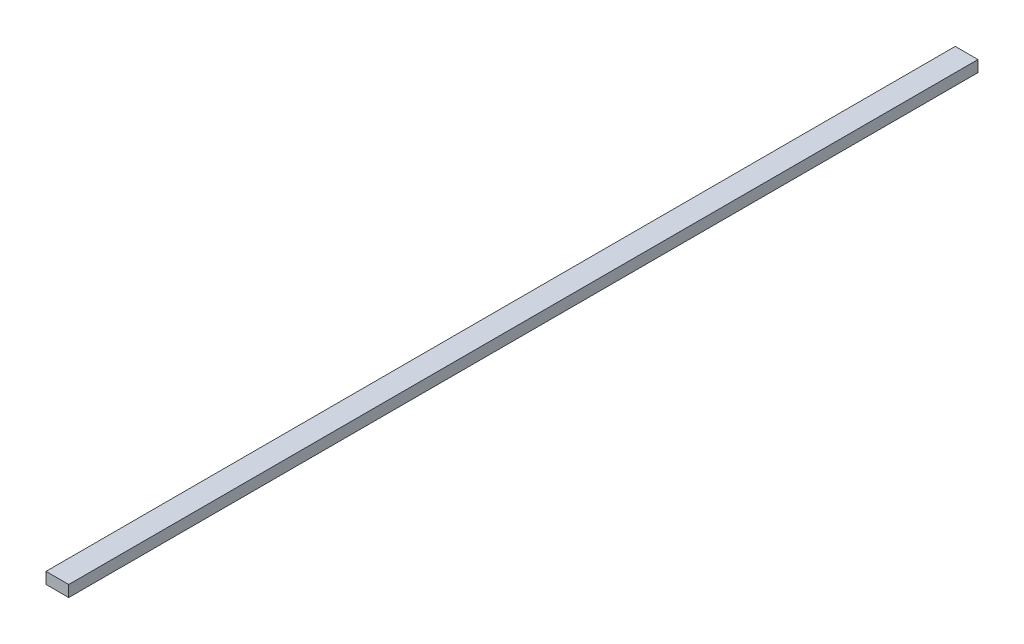
ISO-10303-21;
HEADER;
FILE_DESCRIPTION(('STEP AP214'),'2;1');
FILE_NAME('part.step','',(''),(''),'','','');
FILE_SCHEMA(('AUTOMOTIVE_DESIGN { 1 0 10303 214 1 1 1 1 }'));
ENDSEC;
DATA;
#1=APPLICATION_CONTEXT('core data for automotive mechanical design processes');
#2=APPLICATION_PROTOCOL_DEFINITION('international standard','automotive_design',2000,#1);
#3=PRODUCT_CONTEXT('',#1,'mechanical');
#4=PRODUCT('Part','Part','',(#3));
#5=PRODUCT_RELATED_PRODUCT_CATEGORY('part','',(#4));
#6=PRODUCT_DEFINITION_FORMATION('','',#4);
#7=PRODUCT_DEFINITION_CONTEXT('part definition',#1,'design');
#8=PRODUCT_DEFINITION('design','',#6,#7);
#9=PRODUCT_DEFINITION_SHAPE('','',#8);
#10=(LENGTH_UNIT() NAMED_UNIT(*) SI_UNIT(.MILLI.,.METRE.));
#11=(NAMED_UNIT(*) PLANE_ANGLE_UNIT() SI_UNIT($,.RADIAN.));
#12=(NAMED_UNIT(*) SI_UNIT($,.STERADIAN.) SOLID_ANGLE_UNIT());
#13=UNCERTAINTY_MEASURE_WITH_UNIT(LENGTH_MEASURE(1.E-05),#10,'distance_accuracy_value','');
#14=(GEOMETRIC_REPRESENTATION_CONTEXT(3) GLOBAL_UNCERTAINTY_ASSIGNED_CONTEXT((#13)) GLOBAL_UNIT_ASSIGNED_CONTEXT((#10,
#11,#12)) REPRESENTATION_CONTEXT('',''));
#15=CARTESIAN_POINT('',(0.,0.,0.));
#16=DIRECTION('',(0.,0.,1.));
#17=DIRECTION('',(1.,0.,0.));
#18=AXIS2_PLACEMENT_3D('',#15,#16,#17);
#19=CARTESIAN_POINT('',(6.25,-3.125,500.));
#20=DIRECTION('',(-1.,0.,0.));
#21=DIRECTION('',(0.,0.,1.));
#22=AXIS2_PLACEMENT_3D('',#19,#20,#21);
#23=PLANE('',#22);
#24=DIRECTION('',(0.,1.,0.));
#25=VECTOR('',#24,1.);
#26=CARTESIAN_POINT('',(6.25,-3.125,0.));
#27=LINE('',#26,#25);
#28=CARTESIAN_POINT('',(6.25,-3.125,0.));
#29=VERTEX_POINT('',#28);
#30=CARTESIAN_POINT('',(6.25,3.125,0.));
#31=VERTEX_POINT('',#30);
#32=EDGE_CURVE('E107',#29,#31,#27,.T.);
#33=ORIENTED_EDGE('',*,*,#32,.T.);
#34=DIRECTION('',(0.,0.,-1.));
#35=VECTOR('',#34,1.);
#36=CARTESIAN_POINT('',(6.25,3.125,500.));
#37=LINE('',#36,#35);
#38=CARTESIAN_POINT('',(6.25,3.125,500.));
#39=VERTEX_POINT('',#38);
#40=EDGE_CURVE('E11',#39,#31,#37,.T.);
#41=ORIENTED_EDGE('',*,*,#40,.F.);
#42=DIRECTION('',(0.,1.,0.));
#43=VECTOR('',#42,1.);
#44=CARTESIAN_POINT('',(6.25,-3.125,500.));
#45=LINE('',#44,#43);
#46=CARTESIAN_POINT('',(6.25,-3.125,500.));
#47=VERTEX_POINT('',#46);
#48=EDGE_CURVE('E91',#47,#39,#45,.T.);
#49=ORIENTED_EDGE('',*,*,#48,.F.);
#50=DIRECTION('',(0.,0.,-1.));
#51=VECTOR('',#50,1.);
#52=CARTESIAN_POINT('',(6.25,-3.125,500.));
#53=LINE('',#52,#51);
#54=EDGE_CURVE('E103',#47,#29,#53,.T.);
#55=ORIENTED_EDGE('',*,*,#54,.T.);
#56=EDGE_LOOP('',(#33,#41,#49,#55));
#57=FACE_BOUND('',#56,.T.);
#58=ADVANCED_FACE('F39',(#57),#23,.F.);
#59=CARTESIAN_POINT('',(-6.25,3.125,500.));
#60=DIRECTION('',(0.,-1.,0.));
#61=DIRECTION('',(0.,0.,-1.));
#62=AXIS2_PLACEMENT_3D('',#59,#60,#61);
#63=PLANE('',#62);
#64=DIRECTION('',(-1.,0.,0.));
#65=VECTOR('',#64,1.);
#66=CARTESIAN_POINT('',(-6.25,3.125,0.));
#67=LINE('',#66,#65);
#68=CARTESIAN_POINT('',(-6.25,3.125,0.));
#69=VERTEX_POINT('',#68);
#70=EDGE_CURVE('E96',#31,#69,#67,.T.);
#71=ORIENTED_EDGE('',*,*,#70,.T.);
#72=DIRECTION('',(0.,0.,-1.));
#73=VECTOR('',#72,1.);
#74=CARTESIAN_POINT('',(-6.25,3.125,500.));
#75=LINE('',#74,#73);
#76=CARTESIAN_POINT('',(-6.25,3.125,500.));
#77=VERTEX_POINT('',#76);
#78=EDGE_CURVE('E48',#77,#69,#75,.T.);
#79=ORIENTED_EDGE('',*,*,#78,.F.);
#80=DIRECTION('',(-1.,0.,0.));
#81=VECTOR('',#80,1.);
#82=CARTESIAN_POINT('',(-6.25,3.125,500.));
#83=LINE('',#82,#81);
#84=EDGE_CURVE('E86',#39,#77,#83,.T.);
#85=ORIENTED_EDGE('',*,*,#84,.F.);
#86=ORIENTED_EDGE('',*,*,#40,.T.);
#87=EDGE_LOOP('',(#71,#79,#85,#86));
#88=FACE_BOUND('',#87,.T.);
#89=ADVANCED_FACE('F95',(#88),#63,.F.);
#90=CARTESIAN_POINT('',(-6.25,-3.125,500.));
#91=DIRECTION('',(1.,0.,0.));
#92=DIRECTION('',(0.,0.,-1.));
#93=AXIS2_PLACEMENT_3D('',#90,#91,#92);
#94=PLANE('',#93);
#95=DIRECTION('',(0.,-1.,0.));
#96=VECTOR('',#95,1.);
#97=CARTESIAN_POINT('',(-6.25,-3.125,0.));
#98=LINE('',#97,#96);
#99=CARTESIAN_POINT('',(-6.25,-3.125,0.));
#100=VERTEX_POINT('',#99);
#101=EDGE_CURVE('E73',#69,#100,#98,.T.);
#102=ORIENTED_EDGE('',*,*,#101,.T.);
#103=DIRECTION('',(0.,0.,-1.));
#104=VECTOR('',#103,1.);
#105=CARTESIAN_POINT('',(-6.25,-3.125,500.));
#106=LINE('',#105,#104);
#107=CARTESIAN_POINT('',(-6.25,-3.125,500.));
#108=VERTEX_POINT('',#107);
#109=EDGE_CURVE('E98',#108,#100,#106,.T.);
#110=ORIENTED_EDGE('',*,*,#109,.F.);
#111=DIRECTION('',(0.,-1.,0.));
#112=VECTOR('',#111,1.);
#113=CARTESIAN_POINT('',(-6.25,-3.125,500.));
#114=LINE('',#113,#112);
#115=EDGE_CURVE('E89',#77,#108,#114,.T.);
#116=ORIENTED_EDGE('',*,*,#115,.F.);
#117=ORIENTED_EDGE('',*,*,#78,.T.);
#118=EDGE_LOOP('',(#102,#110,#116,#117));
#119=FACE_BOUND('',#118,.T.);
#120=ADVANCED_FACE('F99',(#119),#94,.F.);
#121=CARTESIAN_POINT('',(-6.25,-3.125,500.));
#122=DIRECTION('',(0.,1.,0.));
#123=DIRECTION('',(0.,0.,1.));
#124=AXIS2_PLACEMENT_3D('',#121,#122,#123);
#125=PLANE('',#124);
#126=DIRECTION('',(1.,0.,0.));
#127=VECTOR('',#126,1.);
#128=CARTESIAN_POINT('',(-6.25,-3.125,0.));
#129=LINE('',#128,#127);
#130=EDGE_CURVE('E79',#100,#29,#129,.T.);
#131=ORIENTED_EDGE('',*,*,#130,.T.);
#132=ORIENTED_EDGE('',*,*,#54,.F.);
#133=DIRECTION('',(1.,0.,0.));
#134=VECTOR('',#133,1.);
#135=CARTESIAN_POINT('',(-6.25,-3.125,500.));
#136=LINE('',#135,#134);
#137=EDGE_CURVE('E56',#108,#47,#136,.T.);
#138=ORIENTED_EDGE('',*,*,#137,.F.);
#139=ORIENTED_EDGE('',*,*,#109,.T.);
#140=EDGE_LOOP('',(#131,#132,#138,#139));
#141=FACE_BOUND('',#140,.T.);
#142=ADVANCED_FACE('F120',(#141),#125,.F.);
#143=CARTESIAN_POINT('',(0.,0.,500.));
#144=DIRECTION('',(0.,0.,-1.));
#145=DIRECTION('',(-1.,0.,0.));
#146=AXIS2_PLACEMENT_3D('',#143,#144,#145);
#147=PLANE('',#146);
#148=ORIENTED_EDGE('',*,*,#48,.T.);
#149=ORIENTED_EDGE('',*,*,#84,.T.);
#150=ORIENTED_EDGE('',*,*,#115,.T.);
#151=ORIENTED_EDGE('',*,*,#137,.T.);
#152=EDGE_LOOP('',(#148,#149,#150,#151));
#153=FACE_BOUND('',#152,.T.);
#154=ADVANCED_FACE('F87',(#153),#147,.F.);
#155=CARTESIAN_POINT('',(0.,0.,0.));
#156=DIRECTION('',(0.,0.,-1.));
#157=DIRECTION('',(-1.,0.,0.));
#158=AXIS2_PLACEMENT_3D('',#155,#156,#157);
#159=PLANE('',#158);
#160=ORIENTED_EDGE('',*,*,#32,.F.);
#161=ORIENTED_EDGE('',*,*,#130,.F.);
#162=ORIENTED_EDGE('',*,*,#101,.F.);
#163=ORIENTED_EDGE('',*,*,#70,.F.);
#164=EDGE_LOOP('',(#160,#161,#162,#163));
#165=FACE_BOUND('',#164,.T.);
#166=ADVANCED_FACE('F123',(#165),#159,.T.);
#167=CLOSED_SHELL('',(#58,#89,#120,#142,#154,#166));
#168=MANIFOLD_SOLID_BREP('B2',#167);
#169=ADVANCED_BREP_SHAPE_REPRESENTATION('',(#18,#168),#14);
#170=SHAPE_DEFINITION_REPRESENTATION(#9,#169);
ENDSEC;
END-ISO-10303-21;
